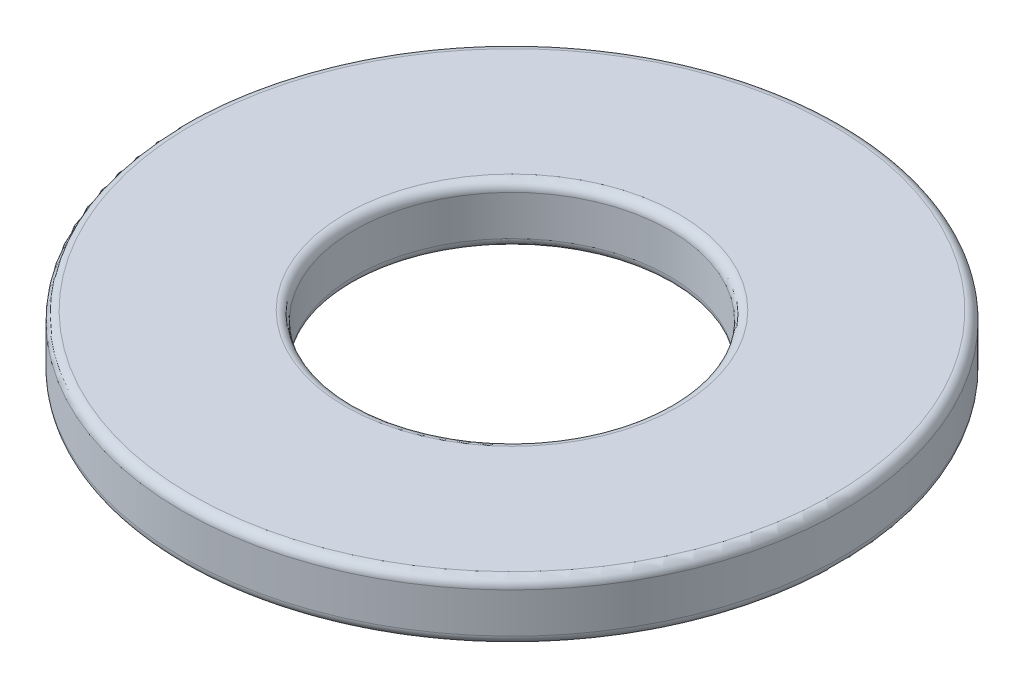
ISO-10303-21;
HEADER;
FILE_DESCRIPTION(('STEP AP214'),'2;1');
FILE_NAME('part.step','',(''),(''),'','','');
FILE_SCHEMA(('AUTOMOTIVE_DESIGN { 1 0 10303 214 1 1 1 1 }'));
ENDSEC;
DATA;
#1=APPLICATION_CONTEXT('core data for automotive mechanical design processes');
#2=APPLICATION_PROTOCOL_DEFINITION('international standard','automotive_design',2000,#1);
#3=PRODUCT_CONTEXT('',#1,'mechanical');
#4=PRODUCT('Part','Part','',(#3));
#5=PRODUCT_RELATED_PRODUCT_CATEGORY('part','',(#4));
#6=PRODUCT_DEFINITION_FORMATION('','',#4);
#7=PRODUCT_DEFINITION_CONTEXT('part definition',#1,'design');
#8=PRODUCT_DEFINITION('design','',#6,#7);
#9=PRODUCT_DEFINITION_SHAPE('','',#8);
#10=(LENGTH_UNIT() NAMED_UNIT(*) SI_UNIT(.MILLI.,.METRE.));
#11=(NAMED_UNIT(*) PLANE_ANGLE_UNIT() SI_UNIT($,.RADIAN.));
#12=(NAMED_UNIT(*) SI_UNIT($,.STERADIAN.) SOLID_ANGLE_UNIT());
#13=UNCERTAINTY_MEASURE_WITH_UNIT(LENGTH_MEASURE(1.E-05),#10,'distance_accuracy_value','');
#14=(GEOMETRIC_REPRESENTATION_CONTEXT(3) GLOBAL_UNCERTAINTY_ASSIGNED_CONTEXT((#13)) GLOBAL_UNIT_ASSIGNED_CONTEXT((#10,
#11,#12)) REPRESENTATION_CONTEXT('',''));
#15=CARTESIAN_POINT('',(0.,0.,0.));
#16=DIRECTION('',(0.,0.,1.));
#17=DIRECTION('',(1.,0.,0.));
#18=AXIS2_PLACEMENT_3D('',#15,#16,#17);
#19=CARTESIAN_POINT('',(0.,0.273,0.));
#20=DIRECTION('',(0.,-1.,0.));
#21=DIRECTION('',(0.,0.,-1.));
#22=AXIS2_PLACEMENT_3D('',#19,#20,#21);
#23=TOROIDAL_SURFACE('',#22,2.277,0.127);
#24=CARTESIAN_POINT('',(0.,0.273,0.));
#25=DIRECTION('',(0.,1.,0.));
#26=DIRECTION('',(0.,0.,1.));
#27=AXIS2_PLACEMENT_3D('',#24,#25,#26);
#28=CIRCLE('',#27,2.15);
#29=CARTESIAN_POINT('',(0.,0.273,2.15));
#30=VERTEX_POINT('',#29);
#31=EDGE_CURVE('E38',#30,#30,#28,.T.);
#32=ORIENTED_EDGE('',*,*,#31,.F.);
#33=EDGE_LOOP('',(#32));
#34=FACE_BOUND('',#33,.T.);
#35=CARTESIAN_POINT('',(0.,0.400000000000001,0.));
#36=DIRECTION('',(0.,-1.,0.));
#37=DIRECTION('',(0.,0.,-1.));
#38=AXIS2_PLACEMENT_3D('',#35,#36,#37);
#39=CIRCLE('',#38,2.277);
#40=CARTESIAN_POINT('',(0.,0.400000000000001,-2.277));
#41=VERTEX_POINT('',#40);
#42=EDGE_CURVE('E19',#41,#41,#39,.T.);
#43=ORIENTED_EDGE('',*,*,#42,.F.);
#44=EDGE_LOOP('',(#43));
#45=FACE_BOUND('',#44,.T.);
#46=ADVANCED_FACE('F15',(#34,#45),#23,.T.);
#47=CARTESIAN_POINT('',(-4.38299999999999,0.4,-4.38299999999999));
#48=DIRECTION('',(0.,1.,0.));
#49=DIRECTION('',(0.,0.,1.));
#50=AXIS2_PLACEMENT_3D('',#47,#48,#49);
#51=PLANE('',#50);
#52=ORIENTED_EDGE('',*,*,#42,.T.);
#53=EDGE_LOOP('',(#52));
#54=FACE_BOUND('',#53,.T.);
#55=CARTESIAN_POINT('',(0.,0.400000000000001,0.));
#56=DIRECTION('',(0.,1.,0.));
#57=DIRECTION('',(0.,0.,1.));
#58=AXIS2_PLACEMENT_3D('',#55,#56,#57);
#59=CIRCLE('',#58,4.37300000000001);
#60=CARTESIAN_POINT('',(0.,0.400000000000001,4.37300000000001));
#61=VERTEX_POINT('',#60);
#62=EDGE_CURVE('E37',#61,#61,#59,.F.);
#63=ORIENTED_EDGE('',*,*,#62,.F.);
#64=EDGE_LOOP('',(#63));
#65=FACE_BOUND('',#64,.T.);
#66=ADVANCED_FACE('F47',(#54,#65),#51,.T.);
#67=CARTESIAN_POINT('',(0.,-0.273,0.));
#68=DIRECTION('',(0.,1.,0.));
#69=DIRECTION('',(0.,0.,1.));
#70=AXIS2_PLACEMENT_3D('',#67,#68,#69);
#71=CYLINDRICAL_SURFACE('',#70,2.15);
#72=ORIENTED_EDGE('',*,*,#31,.T.);
#73=EDGE_LOOP('',(#72));
#74=FACE_BOUND('',#73,.T.);
#75=CARTESIAN_POINT('',(0.,-0.273,0.));
#76=DIRECTION('',(0.,1.,0.));
#77=DIRECTION('',(0.,0.,1.));
#78=AXIS2_PLACEMENT_3D('',#75,#76,#77);
#79=CIRCLE('',#78,2.15);
#80=CARTESIAN_POINT('',(0.,-0.273,2.15));
#81=VERTEX_POINT('',#80);
#82=EDGE_CURVE('E34',#81,#81,#79,.T.);
#83=ORIENTED_EDGE('',*,*,#82,.F.);
#84=EDGE_LOOP('',(#83));
#85=FACE_BOUND('',#84,.T.);
#86=ADVANCED_FACE('F49',(#74,#85),#71,.F.);
#87=CARTESIAN_POINT('',(0.,0.273,0.));
#88=DIRECTION('',(0.,1.,0.));
#89=DIRECTION('',(0.,0.,1.));
#90=AXIS2_PLACEMENT_3D('',#87,#88,#89);
#91=TOROIDAL_SURFACE('',#90,4.37300000000001,0.127);
#92=CARTESIAN_POINT('',(0.,0.273,0.));
#93=DIRECTION('',(0.,-1.,0.));
#94=DIRECTION('',(0.,0.,-1.));
#95=AXIS2_PLACEMENT_3D('',#92,#93,#94);
#96=CIRCLE('',#95,4.50000000000001);
#97=CARTESIAN_POINT('',(0.,0.273,-4.50000000000001));
#98=VERTEX_POINT('',#97);
#99=EDGE_CURVE('E31',#98,#98,#96,.T.);
#100=ORIENTED_EDGE('',*,*,#99,.F.);
#101=EDGE_LOOP('',(#100));
#102=FACE_BOUND('',#101,.T.);
#103=ORIENTED_EDGE('',*,*,#62,.T.);
#104=EDGE_LOOP('',(#103));
#105=FACE_BOUND('',#104,.T.);
#106=ADVANCED_FACE('F45',(#102,#105),#91,.T.);
#107=CARTESIAN_POINT('',(0.,-0.273,0.));
#108=DIRECTION('',(0.,1.,0.));
#109=DIRECTION('',(0.,0.,1.));
#110=AXIS2_PLACEMENT_3D('',#107,#108,#109);
#111=TOROIDAL_SURFACE('',#110,2.277,0.127);
#112=ORIENTED_EDGE('',*,*,#82,.T.);
#113=EDGE_LOOP('',(#112));
#114=FACE_BOUND('',#113,.T.);
#115=CARTESIAN_POINT('',(0.,-0.400000000000001,0.));
#116=DIRECTION('',(0.,1.,0.));
#117=DIRECTION('',(0.,0.,1.));
#118=AXIS2_PLACEMENT_3D('',#115,#116,#117);
#119=CIRCLE('',#118,2.277);
#120=CARTESIAN_POINT('',(0.,-0.400000000000001,2.277));
#121=VERTEX_POINT('',#120);
#122=EDGE_CURVE('E28',#121,#121,#119,.T.);
#123=ORIENTED_EDGE('',*,*,#122,.F.);
#124=EDGE_LOOP('',(#123));
#125=FACE_BOUND('',#124,.T.);
#126=ADVANCED_FACE('F75',(#114,#125),#111,.T.);
#127=CARTESIAN_POINT('',(0.,0.273,0.));
#128=DIRECTION('',(0.,-1.,0.));
#129=DIRECTION('',(0.,0.,-1.));
#130=AXIS2_PLACEMENT_3D('',#127,#128,#129);
#131=CYLINDRICAL_SURFACE('',#130,4.50000000000001);
#132=CARTESIAN_POINT('',(0.,-0.273,0.));
#133=DIRECTION('',(0.,-1.,0.));
#134=DIRECTION('',(0.,0.,-1.));
#135=AXIS2_PLACEMENT_3D('',#132,#133,#134);
#136=CIRCLE('',#135,4.50000000000001);
#137=CARTESIAN_POINT('',(0.,-0.273,-4.50000000000001));
#138=VERTEX_POINT('',#137);
#139=EDGE_CURVE('E10',#138,#138,#136,.T.);
#140=ORIENTED_EDGE('',*,*,#139,.F.);
#141=EDGE_LOOP('',(#140));
#142=FACE_BOUND('',#141,.T.);
#143=ORIENTED_EDGE('',*,*,#99,.T.);
#144=EDGE_LOOP('',(#143));
#145=FACE_BOUND('',#144,.T.);
#146=ADVANCED_FACE('F67',(#142,#145),#131,.T.);
#147=CARTESIAN_POINT('',(-4.38299999999999,-0.4,4.38299999999999));
#148=DIRECTION('',(0.,-1.,0.));
#149=DIRECTION('',(0.,0.,-1.));
#150=AXIS2_PLACEMENT_3D('',#147,#148,#149);
#151=PLANE('',#150);
#152=ORIENTED_EDGE('',*,*,#122,.T.);
#153=EDGE_LOOP('',(#152));
#154=FACE_BOUND('',#153,.T.);
#155=CARTESIAN_POINT('',(0.,-0.400000000000001,0.));
#156=DIRECTION('',(0.,-1.,0.));
#157=DIRECTION('',(0.,0.,-1.));
#158=AXIS2_PLACEMENT_3D('',#155,#156,#157);
#159=CIRCLE('',#158,4.37300000000022);
#160=CARTESIAN_POINT('',(0.,-0.400000000000001,-4.37300000000022));
#161=VERTEX_POINT('',#160);
#162=EDGE_CURVE('E23',#161,#161,#159,.F.);
#163=ORIENTED_EDGE('',*,*,#162,.F.);
#164=EDGE_LOOP('',(#163));
#165=FACE_BOUND('',#164,.T.);
#166=ADVANCED_FACE('F63',(#154,#165),#151,.T.);
#167=CARTESIAN_POINT('',(0.,-0.273,0.));
#168=DIRECTION('',(0.,-1.,0.));
#169=DIRECTION('',(0.,0.,-1.));
#170=AXIS2_PLACEMENT_3D('',#167,#168,#169);
#171=TOROIDAL_SURFACE('',#170,4.37300000000001,0.127);
#172=ORIENTED_EDGE('',*,*,#139,.T.);
#173=EDGE_LOOP('',(#172));
#174=FACE_BOUND('',#173,.T.);
#175=ORIENTED_EDGE('',*,*,#162,.T.);
#176=EDGE_LOOP('',(#175));
#177=FACE_BOUND('',#176,.T.);
#178=ADVANCED_FACE('F17',(#174,#177),#171,.T.);
#179=CLOSED_SHELL('',(#46,#66,#86,#106,#126,#146,#166,#178));
#180=MANIFOLD_SOLID_BREP('B1',#179);
#181=ADVANCED_BREP_SHAPE_REPRESENTATION('',(#18,#180),#14);
#182=SHAPE_DEFINITION_REPRESENTATION(#9,#181);
ENDSEC;
END-ISO-10303-21;
